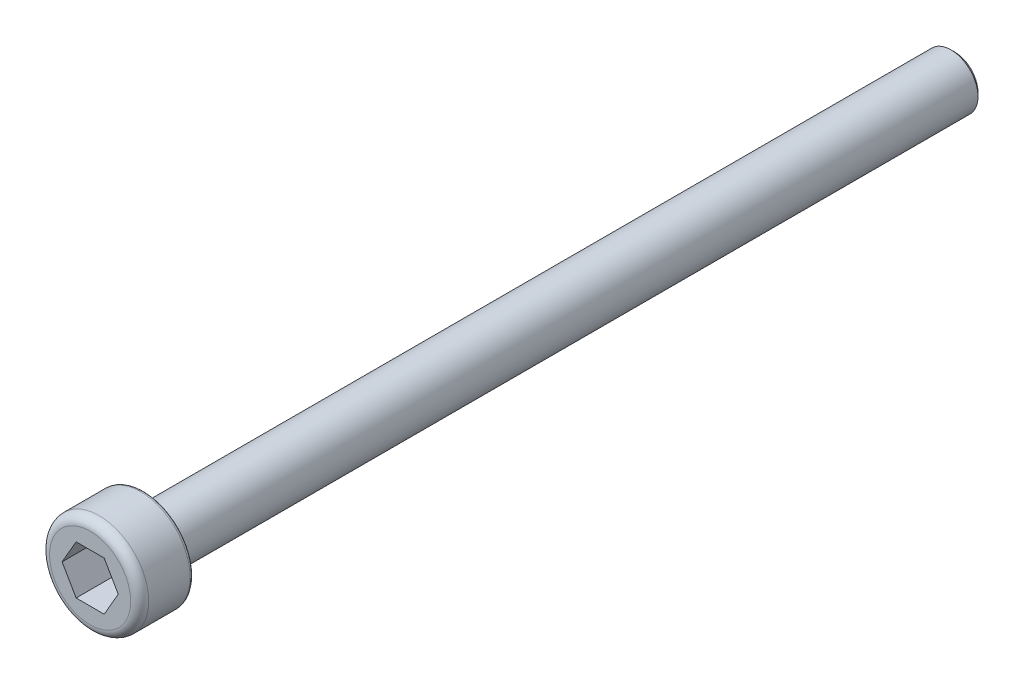
ISO-10303-21;
HEADER;
FILE_DESCRIPTION(('STEP AP214'),'2;1');
FILE_NAME('part.step','',(''),(''),'','','');
FILE_SCHEMA(('AUTOMOTIVE_DESIGN { 1 0 10303 214 1 1 1 1 }'));
ENDSEC;
DATA;
#1=APPLICATION_CONTEXT('core data for automotive mechanical design processes');
#2=APPLICATION_PROTOCOL_DEFINITION('international standard','automotive_design',2000,#1);
#3=PRODUCT_CONTEXT('',#1,'mechanical');
#4=PRODUCT('Part','Part','',(#3));
#5=PRODUCT_RELATED_PRODUCT_CATEGORY('part','',(#4));
#6=PRODUCT_DEFINITION_FORMATION('','',#4);
#7=PRODUCT_DEFINITION_CONTEXT('part definition',#1,'design');
#8=PRODUCT_DEFINITION('design','',#6,#7);
#9=PRODUCT_DEFINITION_SHAPE('','',#8);
#10=(LENGTH_UNIT() NAMED_UNIT(*) SI_UNIT(.MILLI.,.METRE.));
#11=(NAMED_UNIT(*) PLANE_ANGLE_UNIT() SI_UNIT($,.RADIAN.));
#12=(NAMED_UNIT(*) SI_UNIT($,.STERADIAN.) SOLID_ANGLE_UNIT());
#13=UNCERTAINTY_MEASURE_WITH_UNIT(LENGTH_MEASURE(1.E-05),#10,'distance_accuracy_value','');
#14=(GEOMETRIC_REPRESENTATION_CONTEXT(3) GLOBAL_UNCERTAINTY_ASSIGNED_CONTEXT((#13)) GLOBAL_UNIT_ASSIGNED_CONTEXT((#10,
#11,#12)) REPRESENTATION_CONTEXT('',''));
#15=CARTESIAN_POINT('',(0.,0.,0.));
#16=DIRECTION('',(0.,0.,1.));
#17=DIRECTION('',(1.,0.,0.));
#18=AXIS2_PLACEMENT_3D('',#15,#16,#17);
#19=CARTESIAN_POINT('',(0.,0.,0.));
#20=DIRECTION('',(0.,0.,1.));
#21=DIRECTION('',(1.,0.,0.));
#22=AXIS2_PLACEMENT_3D('',#19,#20,#21);
#23=PLANE('',#22);
#24=CARTESIAN_POINT('',(0.,0.,0.));
#25=DIRECTION('',(0.,0.,1.));
#26=DIRECTION('',(1.,0.,0.));
#27=AXIS2_PLACEMENT_3D('',#24,#25,#26);
#28=CIRCLE('',#27,2.55);
#29=CARTESIAN_POINT('',(2.55,0.,0.));
#30=VERTEX_POINT('',#29);
#31=EDGE_CURVE('E11',#30,#30,#28,.F.);
#32=ORIENTED_EDGE('',*,*,#31,.T.);
#33=EDGE_LOOP('',(#32));
#34=FACE_BOUND('',#33,.T.);
#35=CARTESIAN_POINT('',(0.,0.,0.));
#36=DIRECTION('',(0.,0.,1.));
#37=DIRECTION('',(1.,0.,0.));
#38=AXIS2_PLACEMENT_3D('',#35,#36,#37);
#39=CIRCLE('',#38,1.5);
#40=CARTESIAN_POINT('',(1.5,0.,0.));
#41=VERTEX_POINT('',#40);
#42=EDGE_CURVE('E148',#41,#41,#39,.F.);
#43=ORIENTED_EDGE('',*,*,#42,.F.);
#44=EDGE_LOOP('',(#43));
#45=FACE_BOUND('',#44,.T.);
#46=ADVANCED_FACE('F35',(#34,#45),#23,.F.);
#47=CARTESIAN_POINT('',(0.,0.,3.));
#48=DIRECTION('',(0.,0.,-1.));
#49=DIRECTION('',(-1.,0.,0.));
#50=AXIS2_PLACEMENT_3D('',#47,#48,#49);
#51=CYLINDRICAL_SURFACE('',#50,2.75);
#52=CARTESIAN_POINT('',(0.,0.,0.2));
#53=DIRECTION('',(0.,0.,1.));
#54=DIRECTION('',(1.,0.,0.));
#55=AXIS2_PLACEMENT_3D('',#52,#53,#54);
#56=CIRCLE('',#55,2.75);
#57=CARTESIAN_POINT('',(2.75,0.,0.2));
#58=VERTEX_POINT('',#57);
#59=EDGE_CURVE('E43',#58,#58,#56,.T.);
#60=ORIENTED_EDGE('',*,*,#59,.T.);
#61=EDGE_LOOP('',(#60));
#62=FACE_BOUND('',#61,.T.);
#63=CARTESIAN_POINT('',(0.,0.,2.5));
#64=DIRECTION('',(0.,0.,1.));
#65=DIRECTION('',(1.,0.,0.));
#66=AXIS2_PLACEMENT_3D('',#63,#64,#65);
#67=CIRCLE('',#66,2.75);
#68=CARTESIAN_POINT('',(2.75,0.,2.5));
#69=VERTEX_POINT('',#68);
#70=EDGE_CURVE('E145',#69,#69,#67,.F.);
#71=ORIENTED_EDGE('',*,*,#70,.T.);
#72=EDGE_LOOP('',(#71));
#73=FACE_BOUND('',#72,.T.);
#74=ADVANCED_FACE('F159',(#62,#73),#51,.T.);
#75=CARTESIAN_POINT('',(0.,0.,3.));
#76=DIRECTION('',(0.,0.,1.));
#77=DIRECTION('',(1.,0.,0.));
#78=AXIS2_PLACEMENT_3D('',#75,#76,#77);
#79=PLANE('',#78);
#80=DIRECTION('',(0.5,0.866025403784439,0.));
#81=VECTOR('',#80,1.);
#82=CARTESIAN_POINT('',(0.779422863405995,-1.35,3.));
#83=LINE('',#82,#81);
#84=CARTESIAN_POINT('',(0.779422863405995,-1.35,3.));
#85=VERTEX_POINT('',#84);
#86=CARTESIAN_POINT('',(1.55884572681199,0.,3.));
#87=VERTEX_POINT('',#86);
#88=EDGE_CURVE('E50',#85,#87,#83,.T.);
#89=ORIENTED_EDGE('',*,*,#88,.F.);
#90=DIRECTION('',(1.,0.,0.));
#91=VECTOR('',#90,1.);
#92=CARTESIAN_POINT('',(-0.779422863405994,-1.35,3.));
#93=LINE('',#92,#91);
#94=CARTESIAN_POINT('',(-0.779422863405994,-1.35,3.));
#95=VERTEX_POINT('',#94);
#96=EDGE_CURVE('E133',#95,#85,#93,.T.);
#97=ORIENTED_EDGE('',*,*,#96,.F.);
#98=DIRECTION('',(0.5,-0.866025403784438,0.));
#99=VECTOR('',#98,1.);
#100=CARTESIAN_POINT('',(-1.55884572681199,0.,3.));
#101=LINE('',#100,#99);
#102=CARTESIAN_POINT('',(-1.55884572681199,0.,3.));
#103=VERTEX_POINT('',#102);
#104=EDGE_CURVE('E131',#103,#95,#101,.T.);
#105=ORIENTED_EDGE('',*,*,#104,.F.);
#106=DIRECTION('',(-0.5,-0.866025403784438,0.));
#107=VECTOR('',#106,1.);
#108=CARTESIAN_POINT('',(-0.779422863405995,1.35,3.));
#109=LINE('',#108,#107);
#110=CARTESIAN_POINT('',(-0.779422863405995,1.35,3.));
#111=VERTEX_POINT('',#110);
#112=EDGE_CURVE('E98',#111,#103,#109,.T.);
#113=ORIENTED_EDGE('',*,*,#112,.F.);
#114=DIRECTION('',(-1.,0.,0.));
#115=VECTOR('',#114,1.);
#116=CARTESIAN_POINT('',(0.779422863405994,1.35,3.));
#117=LINE('',#116,#115);
#118=CARTESIAN_POINT('',(0.779422863405994,1.35,3.));
#119=VERTEX_POINT('',#118);
#120=EDGE_CURVE('E127',#119,#111,#117,.T.);
#121=ORIENTED_EDGE('',*,*,#120,.F.);
#122=DIRECTION('',(-0.5,0.866025403784438,0.));
#123=VECTOR('',#122,1.);
#124=CARTESIAN_POINT('',(1.55884572681199,0.,3.));
#125=LINE('',#124,#123);
#126=EDGE_CURVE('E124',#87,#119,#125,.T.);
#127=ORIENTED_EDGE('',*,*,#126,.F.);
#128=EDGE_LOOP('',(#89,#97,#105,#113,#121,#127));
#129=FACE_BOUND('',#128,.T.);
#130=CARTESIAN_POINT('',(0.,0.,3.));
#131=DIRECTION('',(0.,0.,1.));
#132=DIRECTION('',(1.,0.,0.));
#133=AXIS2_PLACEMENT_3D('',#130,#131,#132);
#134=CIRCLE('',#133,2.25);
#135=CARTESIAN_POINT('',(2.25,0.,3.));
#136=VERTEX_POINT('',#135);
#137=EDGE_CURVE('E137',#136,#136,#134,.T.);
#138=ORIENTED_EDGE('',*,*,#137,.T.);
#139=EDGE_LOOP('',(#138));
#140=FACE_BOUND('',#139,.T.);
#141=ADVANCED_FACE('F177',(#129,#140),#79,.T.);
#142=CARTESIAN_POINT('',(0.,0.,2.5));
#143=DIRECTION('',(0.,0.,1.));
#144=DIRECTION('',(1.,0.,0.));
#145=AXIS2_PLACEMENT_3D('',#142,#143,#144);
#146=TOROIDAL_SURFACE('',#145,2.25,0.5);
#147=ORIENTED_EDGE('',*,*,#70,.F.);
#148=EDGE_LOOP('',(#147));
#149=FACE_BOUND('',#148,.T.);
#150=ORIENTED_EDGE('',*,*,#137,.F.);
#151=EDGE_LOOP('',(#150));
#152=FACE_BOUND('',#151,.T.);
#153=ADVANCED_FACE('F183',(#149,#152),#146,.T.);
#154=CARTESIAN_POINT('',(0.779422863405995,-1.35,1.));
#155=DIRECTION('',(0.866025403784439,-0.5,0.));
#156=DIRECTION('',(0.5,0.866025403784439,0.));
#157=AXIS2_PLACEMENT_3D('',#154,#155,#156);
#158=PLANE('',#157);
#159=ORIENTED_EDGE('',*,*,#88,.T.);
#160=DIRECTION('',(0.,0.,1.));
#161=VECTOR('',#160,1.);
#162=CARTESIAN_POINT('',(1.55884572681199,0.,1.));
#163=LINE('',#162,#161);
#164=CARTESIAN_POINT('',(1.55884572681199,0.,1.));
#165=VERTEX_POINT('',#164);
#166=EDGE_CURVE('E80',#165,#87,#163,.T.);
#167=ORIENTED_EDGE('',*,*,#166,.F.);
#168=DIRECTION('',(0.5,0.866025403784439,0.));
#169=VECTOR('',#168,1.);
#170=CARTESIAN_POINT('',(0.779422863405995,-1.35,1.));
#171=LINE('',#170,#169);
#172=CARTESIAN_POINT('',(0.779422863405995,-1.35,1.));
#173=VERTEX_POINT('',#172);
#174=EDGE_CURVE('E135',#173,#165,#171,.T.);
#175=ORIENTED_EDGE('',*,*,#174,.F.);
#176=DIRECTION('',(0.,0.,1.));
#177=VECTOR('',#176,1.);
#178=CARTESIAN_POINT('',(0.779422863405995,-1.35,1.));
#179=LINE('',#178,#177);
#180=EDGE_CURVE('E58',#173,#85,#179,.T.);
#181=ORIENTED_EDGE('',*,*,#180,.T.);
#182=EDGE_LOOP('',(#159,#167,#175,#181));
#183=FACE_BOUND('',#182,.T.);
#184=ADVANCED_FACE('F185',(#183),#158,.F.);
#185=CARTESIAN_POINT('',(-0.779422863405994,-1.35,1.));
#186=DIRECTION('',(0.,-1.,0.));
#187=DIRECTION('',(0.,0.,-1.));
#188=AXIS2_PLACEMENT_3D('',#185,#186,#187);
#189=PLANE('',#188);
#190=ORIENTED_EDGE('',*,*,#96,.T.);
#191=ORIENTED_EDGE('',*,*,#180,.F.);
#192=DIRECTION('',(1.,0.,0.));
#193=VECTOR('',#192,1.);
#194=CARTESIAN_POINT('',(-0.779422863405994,-1.35,1.));
#195=LINE('',#194,#193);
#196=CARTESIAN_POINT('',(-0.779422863405994,-1.35,1.));
#197=VERTEX_POINT('',#196);
#198=EDGE_CURVE('E110',#197,#173,#195,.T.);
#199=ORIENTED_EDGE('',*,*,#198,.F.);
#200=DIRECTION('',(0.,0.,1.));
#201=VECTOR('',#200,1.);
#202=CARTESIAN_POINT('',(-0.779422863405994,-1.35,1.));
#203=LINE('',#202,#201);
#204=EDGE_CURVE('E102',#197,#95,#203,.T.);
#205=ORIENTED_EDGE('',*,*,#204,.T.);
#206=EDGE_LOOP('',(#190,#191,#199,#205));
#207=FACE_BOUND('',#206,.T.);
#208=ADVANCED_FACE('F191',(#207),#189,.F.);
#209=CARTESIAN_POINT('',(-1.55884572681199,0.,1.));
#210=DIRECTION('',(-0.866025403784438,-0.5,0.));
#211=DIRECTION('',(0.5,-0.866025403784438,0.));
#212=AXIS2_PLACEMENT_3D('',#209,#210,#211);
#213=PLANE('',#212);
#214=ORIENTED_EDGE('',*,*,#104,.T.);
#215=ORIENTED_EDGE('',*,*,#204,.F.);
#216=DIRECTION('',(0.5,-0.866025403784438,0.));
#217=VECTOR('',#216,1.);
#218=CARTESIAN_POINT('',(-1.55884572681199,0.,1.));
#219=LINE('',#218,#217);
#220=CARTESIAN_POINT('',(-1.55884572681199,0.,1.));
#221=VERTEX_POINT('',#220);
#222=EDGE_CURVE('E106',#221,#197,#219,.T.);
#223=ORIENTED_EDGE('',*,*,#222,.F.);
#224=DIRECTION('',(0.,0.,1.));
#225=VECTOR('',#224,1.);
#226=CARTESIAN_POINT('',(-1.55884572681199,0.,1.));
#227=LINE('',#226,#225);
#228=EDGE_CURVE('E91',#221,#103,#227,.T.);
#229=ORIENTED_EDGE('',*,*,#228,.T.);
#230=EDGE_LOOP('',(#214,#215,#223,#229));
#231=FACE_BOUND('',#230,.T.);
#232=ADVANCED_FACE('F107',(#231),#213,.F.);
#233=CARTESIAN_POINT('',(-0.779422863405995,1.35,1.));
#234=DIRECTION('',(-0.866025403784439,0.5,0.));
#235=DIRECTION('',(-0.5,-0.866025403784439,0.));
#236=AXIS2_PLACEMENT_3D('',#233,#234,#235);
#237=PLANE('',#236);
#238=ORIENTED_EDGE('',*,*,#112,.T.);
#239=ORIENTED_EDGE('',*,*,#228,.F.);
#240=DIRECTION('',(-0.5,-0.866025403784438,0.));
#241=VECTOR('',#240,1.);
#242=CARTESIAN_POINT('',(-0.779422863405995,1.35,1.));
#243=LINE('',#242,#241);
#244=CARTESIAN_POINT('',(-0.779422863405995,1.35,1.));
#245=VERTEX_POINT('',#244);
#246=EDGE_CURVE('E95',#245,#221,#243,.T.);
#247=ORIENTED_EDGE('',*,*,#246,.F.);
#248=DIRECTION('',(0.,0.,1.));
#249=VECTOR('',#248,1.);
#250=CARTESIAN_POINT('',(-0.779422863405995,1.35,1.));
#251=LINE('',#250,#249);
#252=EDGE_CURVE('E103',#245,#111,#251,.T.);
#253=ORIENTED_EDGE('',*,*,#252,.T.);
#254=EDGE_LOOP('',(#238,#239,#247,#253));
#255=FACE_BOUND('',#254,.T.);
#256=ADVANCED_FACE('F93',(#255),#237,.F.);
#257=CARTESIAN_POINT('',(0.779422863405994,1.35,1.));
#258=DIRECTION('',(0.,1.,0.));
#259=DIRECTION('',(0.,0.,1.));
#260=AXIS2_PLACEMENT_3D('',#257,#258,#259);
#261=PLANE('',#260);
#262=ORIENTED_EDGE('',*,*,#120,.T.);
#263=ORIENTED_EDGE('',*,*,#252,.F.);
#264=DIRECTION('',(-1.,0.,0.));
#265=VECTOR('',#264,1.);
#266=CARTESIAN_POINT('',(0.779422863405994,1.35,1.));
#267=LINE('',#266,#265);
#268=CARTESIAN_POINT('',(0.779422863405994,1.35,1.));
#269=VERTEX_POINT('',#268);
#270=EDGE_CURVE('E116',#269,#245,#267,.T.);
#271=ORIENTED_EDGE('',*,*,#270,.F.);
#272=DIRECTION('',(0.,0.,1.));
#273=VECTOR('',#272,1.);
#274=CARTESIAN_POINT('',(0.779422863405994,1.35,1.));
#275=LINE('',#274,#273);
#276=EDGE_CURVE('E140',#269,#119,#275,.T.);
#277=ORIENTED_EDGE('',*,*,#276,.T.);
#278=EDGE_LOOP('',(#262,#263,#271,#277));
#279=FACE_BOUND('',#278,.T.);
#280=ADVANCED_FACE('F216',(#279),#261,.F.);
#281=CARTESIAN_POINT('',(1.55884572681199,0.,1.));
#282=DIRECTION('',(0.866025403784438,0.5,0.));
#283=DIRECTION('',(-0.5,0.866025403784438,0.));
#284=AXIS2_PLACEMENT_3D('',#281,#282,#283);
#285=PLANE('',#284);
#286=ORIENTED_EDGE('',*,*,#126,.T.);
#287=ORIENTED_EDGE('',*,*,#276,.F.);
#288=DIRECTION('',(-0.5,0.866025403784438,0.));
#289=VECTOR('',#288,1.);
#290=CARTESIAN_POINT('',(1.55884572681199,0.,1.));
#291=LINE('',#290,#289);
#292=EDGE_CURVE('E118',#165,#269,#291,.T.);
#293=ORIENTED_EDGE('',*,*,#292,.F.);
#294=ORIENTED_EDGE('',*,*,#166,.T.);
#295=EDGE_LOOP('',(#286,#287,#293,#294));
#296=FACE_BOUND('',#295,.T.);
#297=ADVANCED_FACE('F203',(#296),#285,.F.);
#298=CARTESIAN_POINT('',(0.,0.,1.));
#299=DIRECTION('',(0.,0.,1.));
#300=DIRECTION('',(1.,0.,0.));
#301=AXIS2_PLACEMENT_3D('',#298,#299,#300);
#302=PLANE('',#301);
#303=ORIENTED_EDGE('',*,*,#174,.T.);
#304=ORIENTED_EDGE('',*,*,#292,.T.);
#305=ORIENTED_EDGE('',*,*,#270,.T.);
#306=ORIENTED_EDGE('',*,*,#246,.T.);
#307=ORIENTED_EDGE('',*,*,#222,.T.);
#308=ORIENTED_EDGE('',*,*,#198,.T.);
#309=EDGE_LOOP('',(#303,#304,#305,#306,#307,#308));
#310=FACE_BOUND('',#309,.T.);
#311=ADVANCED_FACE('F113',(#310),#302,.T.);
#312=CARTESIAN_POINT('',(0.,0.,-45.));
#313=DIRECTION('',(0.,0.,1.));
#314=DIRECTION('',(1.,0.,0.));
#315=AXIS2_PLACEMENT_3D('',#312,#313,#314);
#316=CYLINDRICAL_SURFACE('',#315,1.5);
#317=CARTESIAN_POINT('',(0.,0.,-44.8));
#318=DIRECTION('',(0.,0.,-1.));
#319=DIRECTION('',(-1.,0.,0.));
#320=AXIS2_PLACEMENT_3D('',#317,#318,#319);
#321=CIRCLE('',#320,1.5);
#322=CARTESIAN_POINT('',(-1.5,0.,-44.8));
#323=VERTEX_POINT('',#322);
#324=EDGE_CURVE('E154',#323,#323,#321,.F.);
#325=ORIENTED_EDGE('',*,*,#324,.T.);
#326=EDGE_LOOP('',(#325));
#327=FACE_BOUND('',#326,.T.);
#328=ORIENTED_EDGE('',*,*,#42,.T.);
#329=EDGE_LOOP('',(#328));
#330=FACE_BOUND('',#329,.T.);
#331=ADVANCED_FACE('F224',(#327,#330),#316,.T.);
#332=CARTESIAN_POINT('',(0.,0.,-45.));
#333=DIRECTION('',(0.,0.,-1.));
#334=DIRECTION('',(-1.,0.,0.));
#335=AXIS2_PLACEMENT_3D('',#332,#333,#334);
#336=PLANE('',#335);
#337=CARTESIAN_POINT('',(0.,0.,-45.));
#338=DIRECTION('',(0.,0.,-1.));
#339=DIRECTION('',(-1.,0.,0.));
#340=AXIS2_PLACEMENT_3D('',#337,#338,#339);
#341=CIRCLE('',#340,1.30000000000004);
#342=CARTESIAN_POINT('',(-1.30000000000004,0.,-45.));
#343=VERTEX_POINT('',#342);
#344=EDGE_CURVE('E151',#343,#343,#341,.T.);
#345=ORIENTED_EDGE('',*,*,#344,.T.);
#346=EDGE_LOOP('',(#345));
#347=FACE_BOUND('',#346,.T.);
#348=ADVANCED_FACE('F168',(#347),#336,.T.);
#349=CARTESIAN_POINT('',(0.,0.,-45.));
#350=DIRECTION('',(0.,0.,1.));
#351=DIRECTION('',(1.,0.,0.));
#352=AXIS2_PLACEMENT_3D('',#349,#350,#351);
#353=CONICAL_SURFACE('',#352,1.30000000000004,0.785398163397429);
#354=ORIENTED_EDGE('',*,*,#324,.F.);
#355=EDGE_LOOP('',(#354));
#356=FACE_BOUND('',#355,.T.);
#357=ORIENTED_EDGE('',*,*,#344,.F.);
#358=EDGE_LOOP('',(#357));
#359=FACE_BOUND('',#358,.T.);
#360=ADVANCED_FACE('F163',(#356,#359),#353,.T.);
#361=CARTESIAN_POINT('',(0.,0.,0.2));
#362=DIRECTION('',(0.,0.,1.));
#363=DIRECTION('',(1.,0.,0.));
#364=AXIS2_PLACEMENT_3D('',#361,#362,#363);
#365=TOROIDAL_SURFACE('',#364,2.55,0.2);
#366=ORIENTED_EDGE('',*,*,#31,.F.);
#367=EDGE_LOOP('',(#366));
#368=FACE_BOUND('',#367,.T.);
#369=ORIENTED_EDGE('',*,*,#59,.F.);
#370=EDGE_LOOP('',(#369));
#371=FACE_BOUND('',#370,.T.);
#372=ADVANCED_FACE('F37',(#368,#371),#365,.T.);
#373=CLOSED_SHELL('',(#46,#74,#141,#153,#184,#208,#232,#256,#280,#297,#311,#331,#348,#360,#372));
#374=MANIFOLD_SOLID_BREP('B2',#373);
#375=ADVANCED_BREP_SHAPE_REPRESENTATION('',(#18,#374),#14);
#376=SHAPE_DEFINITION_REPRESENTATION(#9,#375);
ENDSEC;
END-ISO-10303-21;
